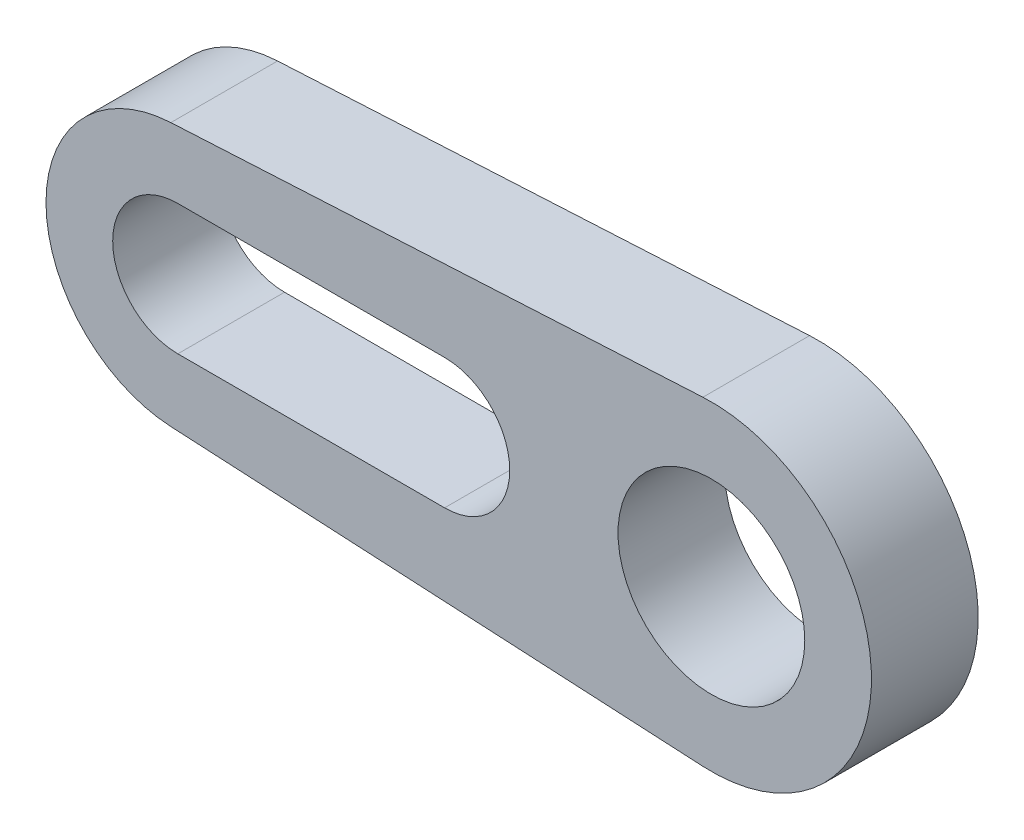
ISO-10303-21;
HEADER;
FILE_DESCRIPTION(('STEP AP214'),'2;1');
FILE_NAME('part.step','',(''),(''),'','','');
FILE_SCHEMA(('AUTOMOTIVE_DESIGN { 1 0 10303 214 1 1 1 1 }'));
ENDSEC;
DATA;
#1=APPLICATION_CONTEXT('core data for automotive mechanical design processes');
#2=APPLICATION_PROTOCOL_DEFINITION('international standard','automotive_design',2000,#1);
#3=PRODUCT_CONTEXT('',#1,'mechanical');
#4=PRODUCT('Part','Part','',(#3));
#5=PRODUCT_RELATED_PRODUCT_CATEGORY('part','',(#4));
#6=PRODUCT_DEFINITION_FORMATION('','',#4);
#7=PRODUCT_DEFINITION_CONTEXT('part definition',#1,'design');
#8=PRODUCT_DEFINITION('design','',#6,#7);
#9=PRODUCT_DEFINITION_SHAPE('','',#8);
#10=(LENGTH_UNIT() NAMED_UNIT(*) SI_UNIT(.MILLI.,.METRE.));
#11=(NAMED_UNIT(*) PLANE_ANGLE_UNIT() SI_UNIT($,.RADIAN.));
#12=(NAMED_UNIT(*) SI_UNIT($,.STERADIAN.) SOLID_ANGLE_UNIT());
#13=UNCERTAINTY_MEASURE_WITH_UNIT(LENGTH_MEASURE(1.E-05),#10,'distance_accuracy_value','');
#14=(GEOMETRIC_REPRESENTATION_CONTEXT(3) GLOBAL_UNCERTAINTY_ASSIGNED_CONTEXT((#13)) GLOBAL_UNIT_ASSIGNED_CONTEXT((#10,
#11,#12)) REPRESENTATION_CONTEXT('',''));
#15=CARTESIAN_POINT('',(0.,0.,0.));
#16=DIRECTION('',(0.,0.,1.));
#17=DIRECTION('',(1.,0.,0.));
#18=AXIS2_PLACEMENT_3D('',#15,#16,#17);
#19=CARTESIAN_POINT('',(0.,0.,2.54));
#20=DIRECTION('',(0.,0.,-1.));
#21=DIRECTION('',(-1.,0.,0.));
#22=AXIS2_PLACEMENT_3D('',#19,#20,#21);
#23=CYLINDRICAL_SURFACE('',#22,2.2225);
#24=CARTESIAN_POINT('',(0.,0.,2.54));
#25=DIRECTION('',(0.,0.,1.));
#26=DIRECTION('',(1.,0.,0.));
#27=AXIS2_PLACEMENT_3D('',#24,#25,#26);
#28=CIRCLE('',#27,2.2225);
#29=CARTESIAN_POINT('',(2.2225,0.,2.54));
#30=VERTEX_POINT('',#29);
#31=EDGE_CURVE('E230',#30,#30,#28,.T.);
#32=ORIENTED_EDGE('',*,*,#31,.T.);
#33=EDGE_LOOP('',(#32));
#34=FACE_BOUND('',#33,.T.);
#35=CARTESIAN_POINT('',(0.,0.,0.));
#36=DIRECTION('',(0.,0.,1.));
#37=DIRECTION('',(1.,0.,0.));
#38=AXIS2_PLACEMENT_3D('',#35,#36,#37);
#39=CIRCLE('',#38,2.2225);
#40=CARTESIAN_POINT('',(2.2225,0.,0.));
#41=VERTEX_POINT('',#40);
#42=EDGE_CURVE('E225',#41,#41,#39,.T.);
#43=ORIENTED_EDGE('',*,*,#42,.F.);
#44=EDGE_LOOP('',(#43));
#45=FACE_BOUND('',#44,.T.);
#46=ADVANCED_FACE('F112',(#34,#45),#23,.F.);
#47=CARTESIAN_POINT('',(0.,-1.55,2.54));
#48=DIRECTION('',(0.,1.,0.));
#49=DIRECTION('',(0.,0.,1.));
#50=AXIS2_PLACEMENT_3D('',#47,#48,#49);
#51=PLANE('',#50);
#52=DIRECTION('',(1.,0.,0.));
#53=VECTOR('',#52,1.);
#54=CARTESIAN_POINT('',(0.,-1.55,0.));
#55=LINE('',#54,#53);
#56=CARTESIAN_POINT('',(-12.7,-1.55,0.));
#57=VERTEX_POINT('',#56);
#58=CARTESIAN_POINT('',(-6.35,-1.55,0.));
#59=VERTEX_POINT('',#58);
#60=EDGE_CURVE('E164',#57,#59,#55,.T.);
#61=ORIENTED_EDGE('',*,*,#60,.F.);
#62=DIRECTION('',(0.,0.,-1.));
#63=VECTOR('',#62,1.);
#64=CARTESIAN_POINT('',(-12.7,-1.55,2.54));
#65=LINE('',#64,#63);
#66=CARTESIAN_POINT('',(-12.7,-1.55,2.54));
#67=VERTEX_POINT('',#66);
#68=EDGE_CURVE('E168',#67,#57,#65,.T.);
#69=ORIENTED_EDGE('',*,*,#68,.F.);
#70=DIRECTION('',(1.,0.,0.));
#71=VECTOR('',#70,1.);
#72=CARTESIAN_POINT('',(0.,-1.55,2.54));
#73=LINE('',#72,#71);
#74=CARTESIAN_POINT('',(-6.35,-1.55,2.54));
#75=VERTEX_POINT('',#74);
#76=EDGE_CURVE('E243',#67,#75,#73,.T.);
#77=ORIENTED_EDGE('',*,*,#76,.T.);
#78=DIRECTION('',(0.,0.,-1.));
#79=VECTOR('',#78,1.);
#80=CARTESIAN_POINT('',(-6.35,-1.55,2.54));
#81=LINE('',#80,#79);
#82=EDGE_CURVE('E12',#75,#59,#81,.T.);
#83=ORIENTED_EDGE('',*,*,#82,.T.);
#84=EDGE_LOOP('',(#61,#69,#77,#83));
#85=FACE_BOUND('',#84,.T.);
#86=ADVANCED_FACE('F166',(#85),#51,.T.);
#87=CARTESIAN_POINT('',(-0.20175,-3.80465464102854,2.54));
#88=DIRECTION('',(0.0529527559055118,0.998597018642661,0.));
#89=DIRECTION('',(-0.998597018642661,0.0529527559055118,0.));
#90=AXIS2_PLACEMENT_3D('',#87,#88,#89);
#91=PLANE('',#90);
#92=DIRECTION('',(0.998597018642661,-0.0529527559055118,0.));
#93=VECTOR('',#92,1.);
#94=CARTESIAN_POINT('',(-0.20175,-3.80465464102854,0.));
#95=LINE('',#94,#93);
#96=CARTESIAN_POINT('',(-12.8661392716535,-3.13309814599135,0.));
#97=VERTEX_POINT('',#96);
#98=CARTESIAN_POINT('',(-0.20175,-3.80465464102854,0.));
#99=VERTEX_POINT('',#98);
#100=EDGE_CURVE('E174',#97,#99,#95,.T.);
#101=ORIENTED_EDGE('',*,*,#100,.T.);
#102=DIRECTION('',(0.,0.,-1.));
#103=VECTOR('',#102,1.);
#104=CARTESIAN_POINT('',(-0.20175,-3.80465464102854,2.54));
#105=LINE('',#104,#103);
#106=CARTESIAN_POINT('',(-0.20175,-3.80465464102854,2.54));
#107=VERTEX_POINT('',#106);
#108=EDGE_CURVE('E234',#107,#99,#105,.T.);
#109=ORIENTED_EDGE('',*,*,#108,.F.);
#110=DIRECTION('',(0.998597018642661,-0.0529527559055118,0.));
#111=VECTOR('',#110,1.);
#112=CARTESIAN_POINT('',(-0.20175,-3.80465464102854,2.54));
#113=LINE('',#112,#111);
#114=CARTESIAN_POINT('',(-12.8661392716535,-3.13309814599135,2.54));
#115=VERTEX_POINT('',#114);
#116=EDGE_CURVE('E237',#115,#107,#113,.T.);
#117=ORIENTED_EDGE('',*,*,#116,.F.);
#118=DIRECTION('',(0.,0.,-1.));
#119=VECTOR('',#118,1.);
#120=CARTESIAN_POINT('',(-12.8661392716535,-3.13309814599135,2.54));
#121=LINE('',#120,#119);
#122=EDGE_CURVE('E122',#115,#97,#121,.T.);
#123=ORIENTED_EDGE('',*,*,#122,.T.);
#124=EDGE_LOOP('',(#101,#109,#117,#123));
#125=FACE_BOUND('',#124,.T.);
#126=ADVANCED_FACE('F236',(#125),#91,.F.);
#127=CARTESIAN_POINT('',(0.,0.,2.54));
#128=DIRECTION('',(0.,0.,-1.));
#129=DIRECTION('',(-1.,0.,0.));
#130=AXIS2_PLACEMENT_3D('',#127,#128,#129);
#131=CYLINDRICAL_SURFACE('',#130,3.81);
#132=CARTESIAN_POINT('',(0.,0.,0.));
#133=DIRECTION('',(0.,0.,1.));
#134=DIRECTION('',(1.,0.,0.));
#135=AXIS2_PLACEMENT_3D('',#132,#133,#134);
#136=CIRCLE('',#135,3.81);
#137=CARTESIAN_POINT('',(-0.20175,3.80465464102854,0.));
#138=VERTEX_POINT('',#137);
#139=EDGE_CURVE('E215',#99,#138,#136,.T.);
#140=ORIENTED_EDGE('',*,*,#139,.T.);
#141=DIRECTION('',(0.,0.,-1.));
#142=VECTOR('',#141,1.);
#143=CARTESIAN_POINT('',(-0.20175,3.80465464102854,2.54));
#144=LINE('',#143,#142);
#145=CARTESIAN_POINT('',(-0.20175,3.80465464102854,2.54));
#146=VERTEX_POINT('',#145);
#147=EDGE_CURVE('E232',#146,#138,#144,.T.);
#148=ORIENTED_EDGE('',*,*,#147,.F.);
#149=CARTESIAN_POINT('',(0.,0.,2.54));
#150=DIRECTION('',(0.,0.,1.));
#151=DIRECTION('',(1.,0.,0.));
#152=AXIS2_PLACEMENT_3D('',#149,#150,#151);
#153=CIRCLE('',#152,3.81);
#154=EDGE_CURVE('E242',#107,#146,#153,.T.);
#155=ORIENTED_EDGE('',*,*,#154,.F.);
#156=ORIENTED_EDGE('',*,*,#108,.T.);
#157=EDGE_LOOP('',(#140,#148,#155,#156));
#158=FACE_BOUND('',#157,.T.);
#159=ADVANCED_FACE('F283',(#158),#131,.T.);
#160=CARTESIAN_POINT('',(-0.20175,3.80465464102854,2.54));
#161=DIRECTION('',(-0.0529527559055118,0.998597018642661,0.));
#162=DIRECTION('',(-0.998597018642661,-0.0529527559055118,0.));
#163=AXIS2_PLACEMENT_3D('',#160,#161,#162);
#164=PLANE('',#163);
#165=DIRECTION('',(0.998597018642661,0.0529527559055118,0.));
#166=VECTOR('',#165,1.);
#167=CARTESIAN_POINT('',(-0.20175,3.80465464102854,0.));
#168=LINE('',#167,#166);
#169=CARTESIAN_POINT('',(-12.8661392716535,3.13309814599135,0.));
#170=VERTEX_POINT('',#169);
#171=EDGE_CURVE('E220',#170,#138,#168,.T.);
#172=ORIENTED_EDGE('',*,*,#171,.F.);
#173=DIRECTION('',(0.,0.,-1.));
#174=VECTOR('',#173,1.);
#175=CARTESIAN_POINT('',(-12.8661392716535,3.13309814599135,2.54));
#176=LINE('',#175,#174);
#177=CARTESIAN_POINT('',(-12.8661392716535,3.13309814599135,2.54));
#178=VERTEX_POINT('',#177);
#179=EDGE_CURVE('E209',#178,#170,#176,.T.);
#180=ORIENTED_EDGE('',*,*,#179,.F.);
#181=DIRECTION('',(0.998597018642661,0.0529527559055118,0.));
#182=VECTOR('',#181,1.);
#183=CARTESIAN_POINT('',(-0.20175,3.80465464102854,2.54));
#184=LINE('',#183,#182);
#185=EDGE_CURVE('E245',#178,#146,#184,.T.);
#186=ORIENTED_EDGE('',*,*,#185,.T.);
#187=ORIENTED_EDGE('',*,*,#147,.T.);
#188=EDGE_LOOP('',(#172,#180,#186,#187));
#189=FACE_BOUND('',#188,.T.);
#190=ADVANCED_FACE('F280',(#189),#164,.T.);
#191=CARTESIAN_POINT('',(0.,1.55,2.54));
#192=DIRECTION('',(0.,-1.,0.));
#193=DIRECTION('',(0.,0.,-1.));
#194=AXIS2_PLACEMENT_3D('',#191,#192,#193);
#195=PLANE('',#194);
#196=DIRECTION('',(-1.,0.,0.));
#197=VECTOR('',#196,1.);
#198=CARTESIAN_POINT('',(0.,1.55,0.));
#199=LINE('',#198,#197);
#200=CARTESIAN_POINT('',(-6.35,1.55,0.));
#201=VERTEX_POINT('',#200);
#202=CARTESIAN_POINT('',(-12.7,1.55,0.));
#203=VERTEX_POINT('',#202);
#204=EDGE_CURVE('E191',#201,#203,#199,.T.);
#205=ORIENTED_EDGE('',*,*,#204,.F.);
#206=DIRECTION('',(0.,0.,-1.));
#207=VECTOR('',#206,1.);
#208=CARTESIAN_POINT('',(-6.35,1.55,2.54));
#209=LINE('',#208,#207);
#210=CARTESIAN_POINT('',(-6.35,1.55,2.54));
#211=VERTEX_POINT('',#210);
#212=EDGE_CURVE('E131',#211,#201,#209,.T.);
#213=ORIENTED_EDGE('',*,*,#212,.F.);
#214=DIRECTION('',(-1.,0.,0.));
#215=VECTOR('',#214,1.);
#216=CARTESIAN_POINT('',(0.,1.55,2.54));
#217=LINE('',#216,#215);
#218=CARTESIAN_POINT('',(-12.7,1.55,2.54));
#219=VERTEX_POINT('',#218);
#220=EDGE_CURVE('E252',#211,#219,#217,.T.);
#221=ORIENTED_EDGE('',*,*,#220,.T.);
#222=DIRECTION('',(0.,0.,-1.));
#223=VECTOR('',#222,1.);
#224=CARTESIAN_POINT('',(-12.7,1.55,2.54));
#225=LINE('',#224,#223);
#226=EDGE_CURVE('E186',#219,#203,#225,.T.);
#227=ORIENTED_EDGE('',*,*,#226,.T.);
#228=EDGE_LOOP('',(#205,#213,#221,#227));
#229=FACE_BOUND('',#228,.T.);
#230=ADVANCED_FACE('F277',(#229),#195,.T.);
#231=CARTESIAN_POINT('',(-6.35,0.,2.54));
#232=DIRECTION('',(0.,0.,-1.));
#233=DIRECTION('',(-1.,0.,0.));
#234=AXIS2_PLACEMENT_3D('',#231,#232,#233);
#235=CYLINDRICAL_SURFACE('',#234,1.55);
#236=CARTESIAN_POINT('',(-6.35,0.,0.));
#237=DIRECTION('',(0.,0.,1.));
#238=DIRECTION('',(1.,0.,0.));
#239=AXIS2_PLACEMENT_3D('',#236,#237,#238);
#240=CIRCLE('',#239,1.55);
#241=EDGE_CURVE('E175',#59,#201,#240,.T.);
#242=ORIENTED_EDGE('',*,*,#241,.F.);
#243=ORIENTED_EDGE('',*,*,#82,.F.);
#244=CARTESIAN_POINT('',(-6.35,0.,2.54));
#245=DIRECTION('',(0.,0.,1.));
#246=DIRECTION('',(1.,0.,0.));
#247=AXIS2_PLACEMENT_3D('',#244,#245,#246);
#248=CIRCLE('',#247,1.55);
#249=EDGE_CURVE('E228',#75,#211,#248,.T.);
#250=ORIENTED_EDGE('',*,*,#249,.T.);
#251=ORIENTED_EDGE('',*,*,#212,.T.);
#252=EDGE_LOOP('',(#242,#243,#250,#251));
#253=FACE_BOUND('',#252,.T.);
#254=ADVANCED_FACE('F267',(#253),#235,.F.);
#255=CARTESIAN_POINT('',(0.,0.,0.));
#256=DIRECTION('',(0.,0.,1.));
#257=DIRECTION('',(1.,0.,0.));
#258=AXIS2_PLACEMENT_3D('',#255,#256,#257);
#259=PLANE('',#258);
#260=CARTESIAN_POINT('',(-12.7,0.,0.));
#261=DIRECTION('',(0.,0.,1.));
#262=DIRECTION('',(1.,0.,0.));
#263=AXIS2_PLACEMENT_3D('',#260,#261,#262);
#264=CIRCLE('',#263,1.55);
#265=EDGE_CURVE('E182',#203,#57,#264,.T.);
#266=ORIENTED_EDGE('',*,*,#265,.T.);
#267=ORIENTED_EDGE('',*,*,#60,.T.);
#268=ORIENTED_EDGE('',*,*,#241,.T.);
#269=ORIENTED_EDGE('',*,*,#204,.T.);
#270=EDGE_LOOP('',(#266,#267,#268,#269));
#271=FACE_BOUND('',#270,.T.);
#272=ORIENTED_EDGE('',*,*,#100,.F.);
#273=CARTESIAN_POINT('',(-12.7,0.,0.));
#274=DIRECTION('',(0.,0.,1.));
#275=DIRECTION('',(1.,0.,0.));
#276=AXIS2_PLACEMENT_3D('',#273,#274,#275);
#277=CIRCLE('',#276,3.1375);
#278=EDGE_CURVE('E116',#170,#97,#277,.T.);
#279=ORIENTED_EDGE('',*,*,#278,.F.);
#280=ORIENTED_EDGE('',*,*,#171,.T.);
#281=ORIENTED_EDGE('',*,*,#139,.F.);
#282=EDGE_LOOP('',(#272,#279,#280,#281));
#283=FACE_BOUND('',#282,.T.);
#284=ORIENTED_EDGE('',*,*,#42,.T.);
#285=EDGE_LOOP('',(#284));
#286=FACE_BOUND('',#285,.T.);
#287=ADVANCED_FACE('F189',(#271,#283,#286),#259,.F.);
#288=CARTESIAN_POINT('',(0.,0.,2.54));
#289=DIRECTION('',(0.,0.,1.));
#290=DIRECTION('',(1.,0.,0.));
#291=AXIS2_PLACEMENT_3D('',#288,#289,#290);
#292=PLANE('',#291);
#293=ORIENTED_EDGE('',*,*,#76,.F.);
#294=CARTESIAN_POINT('',(-12.7,0.,2.54));
#295=DIRECTION('',(0.,0.,1.));
#296=DIRECTION('',(1.,0.,0.));
#297=AXIS2_PLACEMENT_3D('',#294,#295,#296);
#298=CIRCLE('',#297,1.55);
#299=EDGE_CURVE('E185',#219,#67,#298,.T.);
#300=ORIENTED_EDGE('',*,*,#299,.F.);
#301=ORIENTED_EDGE('',*,*,#220,.F.);
#302=ORIENTED_EDGE('',*,*,#249,.F.);
#303=EDGE_LOOP('',(#293,#300,#301,#302));
#304=FACE_BOUND('',#303,.T.);
#305=CARTESIAN_POINT('',(-12.7,0.,2.54));
#306=DIRECTION('',(0.,0.,1.));
#307=DIRECTION('',(1.,0.,0.));
#308=AXIS2_PLACEMENT_3D('',#305,#306,#307);
#309=CIRCLE('',#308,3.1375);
#310=EDGE_CURVE('E195',#178,#115,#309,.T.);
#311=ORIENTED_EDGE('',*,*,#310,.T.);
#312=ORIENTED_EDGE('',*,*,#116,.T.);
#313=ORIENTED_EDGE('',*,*,#154,.T.);
#314=ORIENTED_EDGE('',*,*,#185,.F.);
#315=EDGE_LOOP('',(#311,#312,#313,#314));
#316=FACE_BOUND('',#315,.T.);
#317=ORIENTED_EDGE('',*,*,#31,.F.);
#318=EDGE_LOOP('',(#317));
#319=FACE_BOUND('',#318,.T.);
#320=ADVANCED_FACE('F259',(#304,#316,#319),#292,.T.);
#321=CARTESIAN_POINT('',(-12.7,0.,2.54));
#322=DIRECTION('',(0.,0.,-1.));
#323=DIRECTION('',(-1.,0.,0.));
#324=AXIS2_PLACEMENT_3D('',#321,#322,#323);
#325=CYLINDRICAL_SURFACE('',#324,1.55);
#326=ORIENTED_EDGE('',*,*,#265,.F.);
#327=ORIENTED_EDGE('',*,*,#226,.F.);
#328=ORIENTED_EDGE('',*,*,#299,.T.);
#329=ORIENTED_EDGE('',*,*,#68,.T.);
#330=EDGE_LOOP('',(#326,#327,#328,#329));
#331=FACE_BOUND('',#330,.T.);
#332=ADVANCED_FACE('F180',(#331),#325,.F.);
#333=CARTESIAN_POINT('',(-12.7,0.,2.54));
#334=DIRECTION('',(0.,0.,-1.));
#335=DIRECTION('',(-1.,0.,0.));
#336=AXIS2_PLACEMENT_3D('',#333,#334,#335);
#337=CYLINDRICAL_SURFACE('',#336,3.1375);
#338=ORIENTED_EDGE('',*,*,#278,.T.);
#339=ORIENTED_EDGE('',*,*,#122,.F.);
#340=ORIENTED_EDGE('',*,*,#310,.F.);
#341=ORIENTED_EDGE('',*,*,#179,.T.);
#342=EDGE_LOOP('',(#338,#339,#340,#341));
#343=FACE_BOUND('',#342,.T.);
#344=ADVANCED_FACE('F114',(#343),#337,.T.);
#345=CLOSED_SHELL('',(#46,#86,#126,#159,#190,#230,#254,#287,#320,#332,#344));
#346=MANIFOLD_SOLID_BREP('B2',#345);
#347=ADVANCED_BREP_SHAPE_REPRESENTATION('',(#18,#346),#14);
#348=SHAPE_DEFINITION_REPRESENTATION(#9,#347);
ENDSEC;
END-ISO-10303-21;
